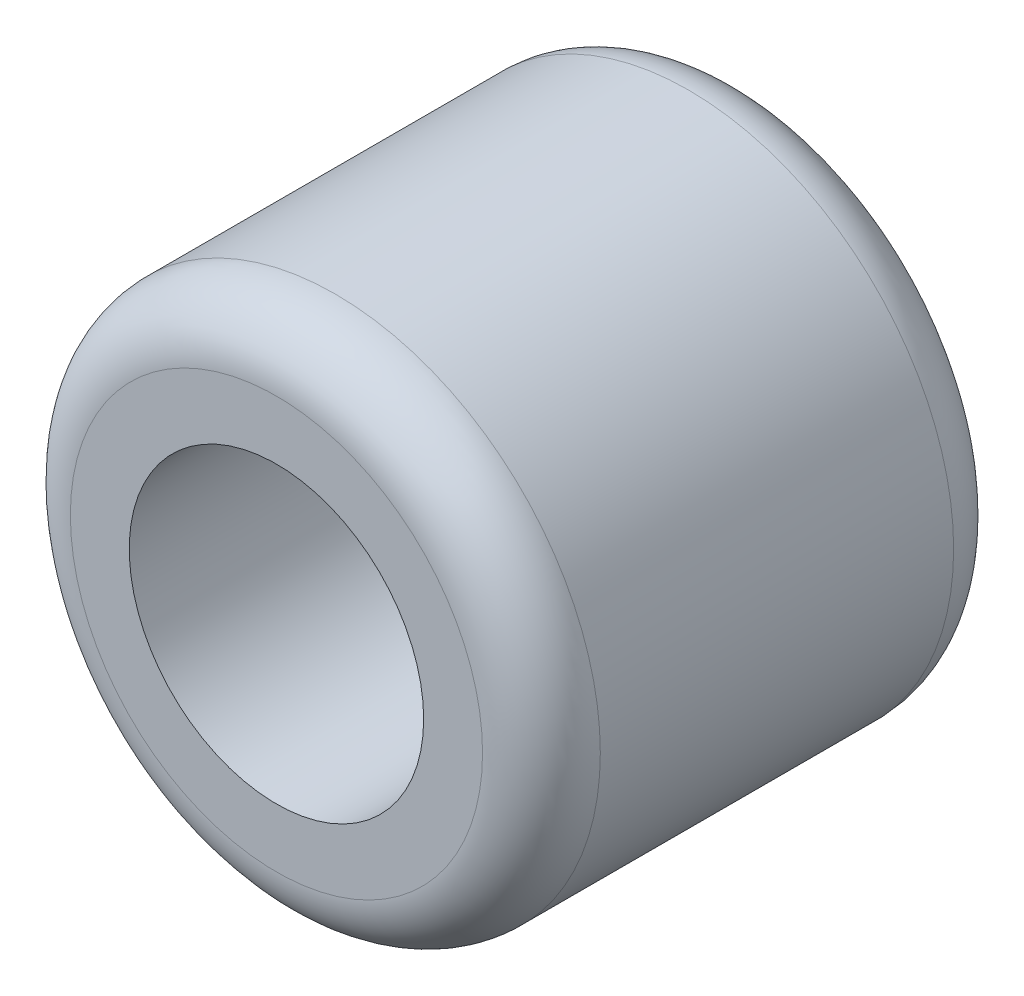
ISO-10303-21;
HEADER;
FILE_DESCRIPTION(('STEP AP214'),'2;1');
FILE_NAME('part.step','',(''),(''),'','','');
FILE_SCHEMA(('AUTOMOTIVE_DESIGN { 1 0 10303 214 1 1 1 1 }'));
ENDSEC;
DATA;
#1=APPLICATION_CONTEXT('core data for automotive mechanical design processes');
#2=APPLICATION_PROTOCOL_DEFINITION('international standard','automotive_design',2000,#1);
#3=PRODUCT_CONTEXT('',#1,'mechanical');
#4=PRODUCT('Part','Part','',(#3));
#5=PRODUCT_RELATED_PRODUCT_CATEGORY('part','',(#4));
#6=PRODUCT_DEFINITION_FORMATION('','',#4);
#7=PRODUCT_DEFINITION_CONTEXT('part definition',#1,'design');
#8=PRODUCT_DEFINITION('design','',#6,#7);
#9=PRODUCT_DEFINITION_SHAPE('','',#8);
#10=(LENGTH_UNIT() NAMED_UNIT(*) SI_UNIT(.MILLI.,.METRE.));
#11=(NAMED_UNIT(*) PLANE_ANGLE_UNIT() SI_UNIT($,.RADIAN.));
#12=(NAMED_UNIT(*) SI_UNIT($,.STERADIAN.) SOLID_ANGLE_UNIT());
#13=UNCERTAINTY_MEASURE_WITH_UNIT(LENGTH_MEASURE(1.E-05),#10,'distance_accuracy_value','');
#14=(GEOMETRIC_REPRESENTATION_CONTEXT(3) GLOBAL_UNCERTAINTY_ASSIGNED_CONTEXT((#13)) GLOBAL_UNIT_ASSIGNED_CONTEXT((#10,
#11,#12)) REPRESENTATION_CONTEXT('',''));
#15=CARTESIAN_POINT('',(0.,0.,0.));
#16=DIRECTION('',(0.,0.,1.));
#17=DIRECTION('',(1.,0.,0.));
#18=AXIS2_PLACEMENT_3D('',#15,#16,#17);
#19=CARTESIAN_POINT('',(0.,0.,8.));
#20=DIRECTION('',(0.,0.,1.));
#21=DIRECTION('',(1.,0.,0.));
#22=AXIS2_PLACEMENT_3D('',#19,#20,#21);
#23=PLANE('',#22);
#24=CARTESIAN_POINT('',(0.,0.,8.));
#25=DIRECTION('',(0.,0.,1.));
#26=DIRECTION('',(1.,0.,0.));
#27=AXIS2_PLACEMENT_3D('',#24,#25,#26);
#28=CIRCLE('',#27,3.5);
#29=CARTESIAN_POINT('',(3.5,0.,8.));
#30=VERTEX_POINT('',#29);
#31=EDGE_CURVE('E10',#30,#30,#28,.T.);
#32=ORIENTED_EDGE('',*,*,#31,.T.);
#33=EDGE_LOOP('',(#32));
#34=FACE_BOUND('',#33,.T.);
#35=CARTESIAN_POINT('',(0.,0.,8.));
#36=DIRECTION('',(0.,0.,1.));
#37=DIRECTION('',(1.,0.,0.));
#38=AXIS2_PLACEMENT_3D('',#35,#36,#37);
#39=CIRCLE('',#38,2.5);
#40=CARTESIAN_POINT('',(2.5,0.,8.));
#41=VERTEX_POINT('',#40);
#42=EDGE_CURVE('E50',#41,#41,#39,.T.);
#43=ORIENTED_EDGE('',*,*,#42,.F.);
#44=EDGE_LOOP('',(#43));
#45=FACE_BOUND('',#44,.T.);
#46=ADVANCED_FACE('F30',(#34,#45),#23,.T.);
#47=CARTESIAN_POINT('',(0.,0.,0.));
#48=DIRECTION('',(0.,0.,1.));
#49=DIRECTION('',(1.,0.,0.));
#50=AXIS2_PLACEMENT_3D('',#47,#48,#49);
#51=PLANE('',#50);
#52=CARTESIAN_POINT('',(0.,0.,0.));
#53=DIRECTION('',(0.,0.,1.));
#54=DIRECTION('',(1.,0.,0.));
#55=AXIS2_PLACEMENT_3D('',#52,#53,#54);
#56=CIRCLE('',#55,3.5);
#57=CARTESIAN_POINT('',(3.5,0.,0.));
#58=VERTEX_POINT('',#57);
#59=EDGE_CURVE('E37',#58,#58,#56,.F.);
#60=ORIENTED_EDGE('',*,*,#59,.T.);
#61=EDGE_LOOP('',(#60));
#62=FACE_BOUND('',#61,.T.);
#63=CARTESIAN_POINT('',(0.,0.,0.));
#64=DIRECTION('',(0.,0.,1.));
#65=DIRECTION('',(1.,0.,0.));
#66=AXIS2_PLACEMENT_3D('',#63,#64,#65);
#67=CIRCLE('',#66,2.5);
#68=CARTESIAN_POINT('',(2.5,0.,0.));
#69=VERTEX_POINT('',#68);
#70=EDGE_CURVE('E51',#69,#69,#67,.T.);
#71=ORIENTED_EDGE('',*,*,#70,.T.);
#72=EDGE_LOOP('',(#71));
#73=FACE_BOUND('',#72,.T.);
#74=ADVANCED_FACE('F61',(#62,#73),#51,.F.);
#75=CARTESIAN_POINT('',(0.,0.,8.));
#76=DIRECTION('',(0.,0.,-1.));
#77=DIRECTION('',(-1.,0.,0.));
#78=AXIS2_PLACEMENT_3D('',#75,#76,#77);
#79=CYLINDRICAL_SURFACE('',#78,4.5);
#80=CARTESIAN_POINT('',(0.,0.,1.));
#81=DIRECTION('',(0.,0.,1.));
#82=DIRECTION('',(1.,0.,0.));
#83=AXIS2_PLACEMENT_3D('',#80,#81,#82);
#84=CIRCLE('',#83,4.5);
#85=CARTESIAN_POINT('',(4.5,0.,1.));
#86=VERTEX_POINT('',#85);
#87=EDGE_CURVE('E41',#86,#86,#84,.T.);
#88=ORIENTED_EDGE('',*,*,#87,.T.);
#89=EDGE_LOOP('',(#88));
#90=FACE_BOUND('',#89,.T.);
#91=CARTESIAN_POINT('',(0.,0.,7.));
#92=DIRECTION('',(0.,0.,1.));
#93=DIRECTION('',(1.,0.,0.));
#94=AXIS2_PLACEMENT_3D('',#91,#92,#93);
#95=CIRCLE('',#94,4.5);
#96=CARTESIAN_POINT('',(4.5,0.,7.));
#97=VERTEX_POINT('',#96);
#98=EDGE_CURVE('E45',#97,#97,#95,.F.);
#99=ORIENTED_EDGE('',*,*,#98,.T.);
#100=EDGE_LOOP('',(#99));
#101=FACE_BOUND('',#100,.T.);
#102=ADVANCED_FACE('F66',(#90,#101),#79,.T.);
#103=CARTESIAN_POINT('',(0.,0.,8.));
#104=DIRECTION('',(0.,0.,-1.));
#105=DIRECTION('',(-1.,0.,0.));
#106=AXIS2_PLACEMENT_3D('',#103,#104,#105);
#107=CYLINDRICAL_SURFACE('',#106,2.5);
#108=ORIENTED_EDGE('',*,*,#42,.T.);
#109=EDGE_LOOP('',(#108));
#110=FACE_BOUND('',#109,.T.);
#111=ORIENTED_EDGE('',*,*,#70,.F.);
#112=EDGE_LOOP('',(#111));
#113=FACE_BOUND('',#112,.T.);
#114=ADVANCED_FACE('F57',(#110,#113),#107,.F.);
#115=CARTESIAN_POINT('',(0.,0.,1.));
#116=DIRECTION('',(0.,0.,1.));
#117=DIRECTION('',(1.,0.,0.));
#118=AXIS2_PLACEMENT_3D('',#115,#116,#117);
#119=TOROIDAL_SURFACE('',#118,3.5,1.);
#120=ORIENTED_EDGE('',*,*,#59,.F.);
#121=EDGE_LOOP('',(#120));
#122=FACE_BOUND('',#121,.T.);
#123=ORIENTED_EDGE('',*,*,#87,.F.);
#124=EDGE_LOOP('',(#123));
#125=FACE_BOUND('',#124,.T.);
#126=ADVANCED_FACE('F72',(#122,#125),#119,.T.);
#127=CARTESIAN_POINT('',(0.,0.,7.));
#128=DIRECTION('',(0.,0.,1.));
#129=DIRECTION('',(1.,0.,0.));
#130=AXIS2_PLACEMENT_3D('',#127,#128,#129);
#131=TOROIDAL_SURFACE('',#130,3.5,1.);
#132=ORIENTED_EDGE('',*,*,#98,.F.);
#133=EDGE_LOOP('',(#132));
#134=FACE_BOUND('',#133,.T.);
#135=ORIENTED_EDGE('',*,*,#31,.F.);
#136=EDGE_LOOP('',(#135));
#137=FACE_BOUND('',#136,.T.);
#138=ADVANCED_FACE('F32',(#134,#137),#131,.T.);
#139=CLOSED_SHELL('',(#46,#74,#102,#114,#126,#138));
#140=MANIFOLD_SOLID_BREP('B2',#139);
#141=ADVANCED_BREP_SHAPE_REPRESENTATION('',(#18,#140),#14);
#142=SHAPE_DEFINITION_REPRESENTATION(#9,#141);
ENDSEC;
END-ISO-10303-21;
